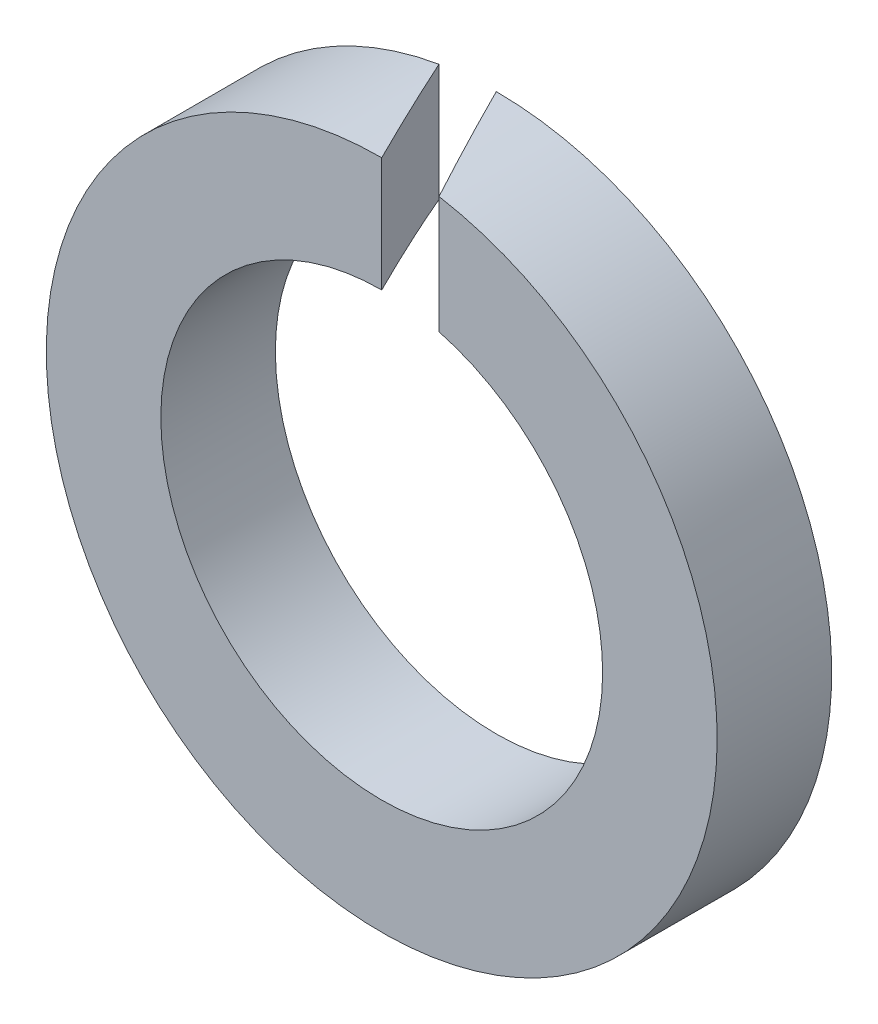
ISO-10303-21;
HEADER;
FILE_DESCRIPTION(('STEP AP214'),'2;1');
FILE_NAME('part.step','',(''),(''),'','','');
FILE_SCHEMA(('AUTOMOTIVE_DESIGN { 1 0 10303 214 1 1 1 1 }'));
ENDSEC;
DATA;
#1=APPLICATION_CONTEXT('core data for automotive mechanical design processes');
#2=APPLICATION_PROTOCOL_DEFINITION('international standard','automotive_design',2000,#1);
#3=PRODUCT_CONTEXT('',#1,'mechanical');
#4=PRODUCT('Part','Part','',(#3));
#5=PRODUCT_RELATED_PRODUCT_CATEGORY('part','',(#4));
#6=PRODUCT_DEFINITION_FORMATION('','',#4);
#7=PRODUCT_DEFINITION_CONTEXT('part definition',#1,'design');
#8=PRODUCT_DEFINITION('design','',#6,#7);
#9=PRODUCT_DEFINITION_SHAPE('','',#8);
#10=(LENGTH_UNIT() NAMED_UNIT(*) SI_UNIT(.MILLI.,.METRE.));
#11=(NAMED_UNIT(*) PLANE_ANGLE_UNIT() SI_UNIT($,.RADIAN.));
#12=(NAMED_UNIT(*) SI_UNIT($,.STERADIAN.) SOLID_ANGLE_UNIT());
#13=UNCERTAINTY_MEASURE_WITH_UNIT(LENGTH_MEASURE(1.E-05),#10,'distance_accuracy_value','');
#14=(GEOMETRIC_REPRESENTATION_CONTEXT(3) GLOBAL_UNCERTAINTY_ASSIGNED_CONTEXT((#13)) GLOBAL_UNIT_ASSIGNED_CONTEXT((#10,
#11,#12)) REPRESENTATION_CONTEXT('',''));
#15=CARTESIAN_POINT('',(0.,0.,0.));
#16=DIRECTION('',(0.,0.,1.));
#17=DIRECTION('',(1.,0.,0.));
#18=AXIS2_PLACEMENT_3D('',#15,#16,#17);
#19=CARTESIAN_POINT('',(0.,0.,2.1));
#20=DIRECTION('',(0.,0.,1.));
#21=DIRECTION('',(1.,0.,0.));
#22=AXIS2_PLACEMENT_3D('',#19,#20,#21);
#23=PLANE('',#22);
#24=CARTESIAN_POINT('',(0.,0.,2.1));
#25=DIRECTION('',(0.,0.,1.));
#26=DIRECTION('',(1.,0.,0.));
#27=AXIS2_PLACEMENT_3D('',#24,#25,#26);
#28=CIRCLE('',#27,4.05);
#29=CARTESIAN_POINT('',(1.05,3.91152144312159,2.1));
#30=VERTEX_POINT('',#29);
#31=CARTESIAN_POINT('',(0.,4.05,2.1));
#32=VERTEX_POINT('',#31);
#33=EDGE_CURVE('E67',#30,#32,#28,.F.);
#34=ORIENTED_EDGE('',*,*,#33,.T.);
#35=DIRECTION('',(0.,1.,0.));
#36=VECTOR('',#35,1.);
#37=CARTESIAN_POINT('',(0.,0.,2.1));
#38=LINE('',#37,#36);
#39=CARTESIAN_POINT('',(0.,6.15,2.1));
#40=VERTEX_POINT('',#39);
#41=EDGE_CURVE('E59',#32,#40,#38,.T.);
#42=ORIENTED_EDGE('',*,*,#41,.T.);
#43=CARTESIAN_POINT('',(0.,0.,2.1));
#44=DIRECTION('',(0.,0.,1.));
#45=DIRECTION('',(1.,0.,0.));
#46=AXIS2_PLACEMENT_3D('',#43,#44,#45);
#47=CIRCLE('',#46,6.15);
#48=CARTESIAN_POINT('',(1.05,6.05970296301725,2.1));
#49=VERTEX_POINT('',#48);
#50=EDGE_CURVE('E79',#49,#40,#47,.F.);
#51=ORIENTED_EDGE('',*,*,#50,.F.);
#52=DIRECTION('',(0.,1.,0.));
#53=VECTOR('',#52,1.);
#54=CARTESIAN_POINT('',(1.05,0.,2.1));
#55=LINE('',#54,#53);
#56=EDGE_CURVE('E72',#49,#30,#55,.F.);
#57=ORIENTED_EDGE('',*,*,#56,.T.);
#58=EDGE_LOOP('',(#34,#42,#51,#57));
#59=FACE_BOUND('',#58,.T.);
#60=ADVANCED_FACE('F17',(#59),#23,.T.);
#61=CARTESIAN_POINT('',(-1.05,0.,0.));
#62=DIRECTION('',(-0.894427190999916,0.,0.447213595499958));
#63=DIRECTION('',(0.447213595499958,0.,0.894427190999916));
#64=AXIS2_PLACEMENT_3D('',#61,#62,#63);
#65=PLANE('',#64);
#66=CARTESIAN_POINT('',(0.,0.,2.1));
#67=DIRECTION('',(-0.894427190999916,0.,0.447213595499958));
#68=DIRECTION('',(0.447213595499958,0.,0.894427190999916));
#69=AXIS2_PLACEMENT_3D('',#66,#67,#68);
#70=ELLIPSE('',#69,13.7518180616237,6.15);
#71=CARTESIAN_POINT('',(-1.05,6.05970296301725,0.));
#72=VERTEX_POINT('',#71);
#73=EDGE_CURVE('E20',#40,#72,#70,.T.);
#74=ORIENTED_EDGE('',*,*,#73,.F.);
#75=ORIENTED_EDGE('',*,*,#41,.F.);
#76=CARTESIAN_POINT('',(0.,0.,2.1));
#77=DIRECTION('',(-0.894427190999916,0.,0.447213595499958));
#78=DIRECTION('',(0.447213595499958,0.,0.894427190999916));
#79=AXIS2_PLACEMENT_3D('',#76,#77,#78);
#80=ELLIPSE('',#79,9.05607530887415,4.05);
#81=CARTESIAN_POINT('',(-1.05,3.91152144312159,0.));
#82=VERTEX_POINT('',#81);
#83=EDGE_CURVE('E62',#32,#82,#80,.T.);
#84=ORIENTED_EDGE('',*,*,#83,.T.);
#85=DIRECTION('',(0.,1.,0.));
#86=VECTOR('',#85,1.);
#87=CARTESIAN_POINT('',(-1.05,0.,0.));
#88=LINE('',#87,#86);
#89=EDGE_CURVE('E69',#82,#72,#88,.T.);
#90=ORIENTED_EDGE('',*,*,#89,.T.);
#91=EDGE_LOOP('',(#74,#75,#84,#90));
#92=FACE_BOUND('',#91,.T.);
#93=ADVANCED_FACE('F60',(#92),#65,.F.);
#94=CARTESIAN_POINT('',(0.,0.,0.));
#95=DIRECTION('',(0.,0.,1.));
#96=DIRECTION('',(1.,0.,0.));
#97=AXIS2_PLACEMENT_3D('',#94,#95,#96);
#98=CYLINDRICAL_SURFACE('',#97,6.15);
#99=CARTESIAN_POINT('',(0.,0.,0.));
#100=DIRECTION('',(0.,0.,1.));
#101=DIRECTION('',(1.,0.,0.));
#102=AXIS2_PLACEMENT_3D('',#99,#100,#101);
#103=CIRCLE('',#102,6.15);
#104=CARTESIAN_POINT('',(0.,6.15,0.));
#105=VERTEX_POINT('',#104);
#106=EDGE_CURVE('E89',#72,#105,#103,.T.);
#107=ORIENTED_EDGE('',*,*,#106,.T.);
#108=CARTESIAN_POINT('',(0.,0.,0.));
#109=DIRECTION('',(0.894427190999916,0.,-0.447213595499958));
#110=DIRECTION('',(0.447213595499958,0.,0.894427190999916));
#111=AXIS2_PLACEMENT_3D('',#108,#109,#110);
#112=ELLIPSE('',#111,13.7518180616237,6.15);
#113=EDGE_CURVE('E77',#105,#49,#112,.T.);
#114=ORIENTED_EDGE('',*,*,#113,.T.);
#115=ORIENTED_EDGE('',*,*,#50,.T.);
#116=ORIENTED_EDGE('',*,*,#73,.T.);
#117=EDGE_LOOP('',(#107,#114,#115,#116));
#118=FACE_BOUND('',#117,.T.);
#119=ADVANCED_FACE('F80',(#118),#98,.T.);
#120=CARTESIAN_POINT('',(1.05,0.,2.1));
#121=DIRECTION('',(0.894427190999916,0.,-0.447213595499958));
#122=DIRECTION('',(-0.447213595499958,0.,-0.894427190999916));
#123=AXIS2_PLACEMENT_3D('',#120,#121,#122);
#124=PLANE('',#123);
#125=CARTESIAN_POINT('',(0.,0.,0.));
#126=DIRECTION('',(0.894427190999916,0.,-0.447213595499958));
#127=DIRECTION('',(0.447213595499958,0.,0.894427190999916));
#128=AXIS2_PLACEMENT_3D('',#125,#126,#127);
#129=ELLIPSE('',#128,9.05607530887415,4.05);
#130=CARTESIAN_POINT('',(0.,4.05,0.));
#131=VERTEX_POINT('',#130);
#132=EDGE_CURVE('E34',#131,#30,#129,.T.);
#133=ORIENTED_EDGE('',*,*,#132,.T.);
#134=ORIENTED_EDGE('',*,*,#56,.F.);
#135=ORIENTED_EDGE('',*,*,#113,.F.);
#136=DIRECTION('',(0.,1.,0.));
#137=VECTOR('',#136,1.);
#138=CARTESIAN_POINT('',(0.,0.,0.));
#139=LINE('',#138,#137);
#140=EDGE_CURVE('E26',#105,#131,#139,.F.);
#141=ORIENTED_EDGE('',*,*,#140,.T.);
#142=EDGE_LOOP('',(#133,#134,#135,#141));
#143=FACE_BOUND('',#142,.T.);
#144=ADVANCED_FACE('F83',(#143),#124,.F.);
#145=CARTESIAN_POINT('',(0.,0.,0.));
#146=DIRECTION('',(0.,0.,1.));
#147=DIRECTION('',(1.,0.,0.));
#148=AXIS2_PLACEMENT_3D('',#145,#146,#147);
#149=CYLINDRICAL_SURFACE('',#148,4.05);
#150=CARTESIAN_POINT('',(0.,0.,0.));
#151=DIRECTION('',(0.,0.,1.));
#152=DIRECTION('',(1.,0.,0.));
#153=AXIS2_PLACEMENT_3D('',#150,#151,#152);
#154=CIRCLE('',#153,4.05);
#155=EDGE_CURVE('E11',#131,#82,#154,.F.);
#156=ORIENTED_EDGE('',*,*,#155,.T.);
#157=ORIENTED_EDGE('',*,*,#83,.F.);
#158=ORIENTED_EDGE('',*,*,#33,.F.);
#159=ORIENTED_EDGE('',*,*,#132,.F.);
#160=EDGE_LOOP('',(#156,#157,#158,#159));
#161=FACE_BOUND('',#160,.T.);
#162=ADVANCED_FACE('F66',(#161),#149,.F.);
#163=CARTESIAN_POINT('',(0.,0.,0.));
#164=DIRECTION('',(0.,0.,1.));
#165=DIRECTION('',(1.,0.,0.));
#166=AXIS2_PLACEMENT_3D('',#163,#164,#165);
#167=PLANE('',#166);
#168=ORIENTED_EDGE('',*,*,#155,.F.);
#169=ORIENTED_EDGE('',*,*,#140,.F.);
#170=ORIENTED_EDGE('',*,*,#106,.F.);
#171=ORIENTED_EDGE('',*,*,#89,.F.);
#172=EDGE_LOOP('',(#168,#169,#170,#171));
#173=FACE_BOUND('',#172,.T.);
#174=ADVANCED_FACE('F91',(#173),#167,.F.);
#175=CLOSED_SHELL('',(#60,#93,#119,#144,#162,#174));
#176=MANIFOLD_SOLID_BREP('B1',#175);
#177=ADVANCED_BREP_SHAPE_REPRESENTATION('',(#18,#176),#14);
#178=SHAPE_DEFINITION_REPRESENTATION(#9,#177);
ENDSEC;
END-ISO-10303-21;
